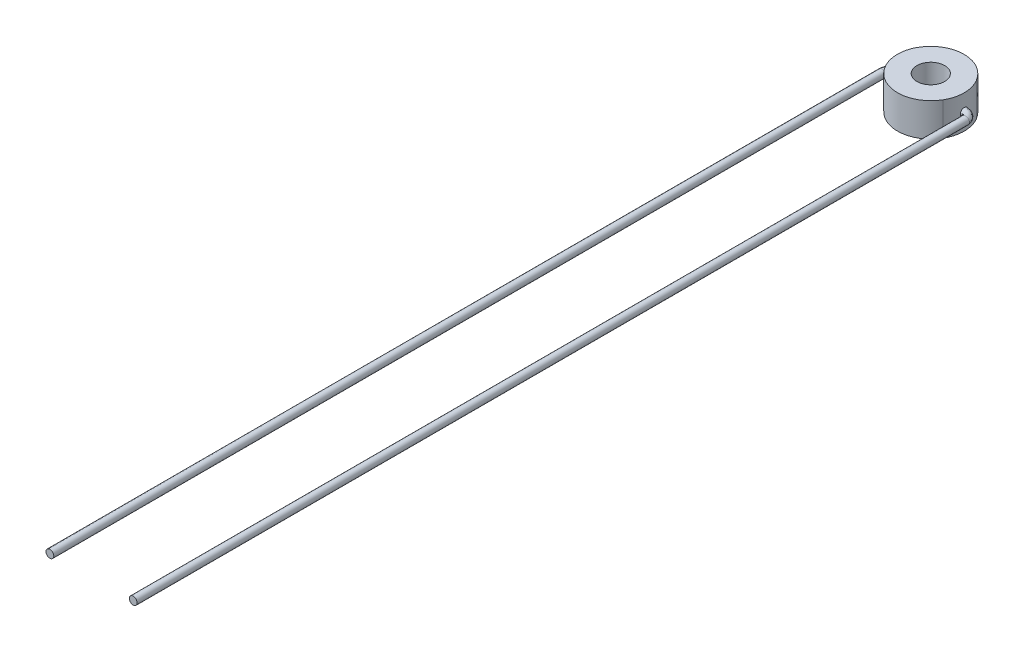
ISO-10303-21;
HEADER;
FILE_DESCRIPTION(('STEP AP214'),'2;1');
FILE_NAME('part.step','',(''),(''),'','','');
FILE_SCHEMA(('AUTOMOTIVE_DESIGN { 1 0 10303 214 1 1 1 1 }'));
ENDSEC;
DATA;
#1=APPLICATION_CONTEXT('core data for automotive mechanical design processes');
#2=APPLICATION_PROTOCOL_DEFINITION('international standard','automotive_design',2000,#1);
#3=PRODUCT_CONTEXT('',#1,'mechanical');
#4=PRODUCT('Part','Part','',(#3));
#5=PRODUCT_RELATED_PRODUCT_CATEGORY('part','',(#4));
#6=PRODUCT_DEFINITION_FORMATION('','',#4);
#7=PRODUCT_DEFINITION_CONTEXT('part definition',#1,'design');
#8=PRODUCT_DEFINITION('design','',#6,#7);
#9=PRODUCT_DEFINITION_SHAPE('','',#8);
#10=(LENGTH_UNIT() NAMED_UNIT(*) SI_UNIT(.MILLI.,.METRE.));
#11=(NAMED_UNIT(*) PLANE_ANGLE_UNIT() SI_UNIT($,.RADIAN.));
#12=(NAMED_UNIT(*) SI_UNIT($,.STERADIAN.) SOLID_ANGLE_UNIT());
#13=UNCERTAINTY_MEASURE_WITH_UNIT(LENGTH_MEASURE(1.E-05),#10,'distance_accuracy_value','');
#14=(GEOMETRIC_REPRESENTATION_CONTEXT(3) GLOBAL_UNCERTAINTY_ASSIGNED_CONTEXT((#13)) GLOBAL_UNIT_ASSIGNED_CONTEXT((#10,
#11,#12)) REPRESENTATION_CONTEXT('',''));
#15=CARTESIAN_POINT('',(0.,0.,0.));
#16=DIRECTION('',(0.,0.,1.));
#17=DIRECTION('',(1.,0.,0.));
#18=AXIS2_PLACEMENT_3D('',#15,#16,#17);
#19=CARTESIAN_POINT('',(-3.01,1.5,0.));
#20=DIRECTION('',(-1.,0.,0.));
#21=DIRECTION('',(0.,-1.,0.));
#22=AXIS2_PLACEMENT_3D('',#19,#20,#21);
#23=PLANE('',#22);
#24=CARTESIAN_POINT('',(-3.01,1.5,0.));
#25=DIRECTION('',(-1.,0.,0.));
#26=DIRECTION('',(0.,-1.,0.));
#27=AXIS2_PLACEMENT_3D('',#24,#25,#26);
#28=CIRCLE('',#27,0.35);
#29=CARTESIAN_POINT('',(-3.01,1.15,0.));
#30=VERTEX_POINT('',#29);
#31=EDGE_CURVE('E127',#30,#30,#28,.T.);
#32=ORIENTED_EDGE('',*,*,#31,.F.);
#33=EDGE_LOOP('',(#32));
#34=FACE_BOUND('',#33,.T.);
#35=ADVANCED_FACE('F114',(#34),#23,.F.);
#36=CARTESIAN_POINT('',(-3.70998545374546,1.5,75.695487290752));
#37=DIRECTION('',(0.,0.,1.));
#38=DIRECTION('',(0.,-1.,0.));
#39=AXIS2_PLACEMENT_3D('',#36,#37,#38);
#40=PLANE('',#39);
#41=CARTESIAN_POINT('',(-3.70998545374546,1.5,75.695487290752));
#42=DIRECTION('',(0.,0.,1.));
#43=DIRECTION('',(0.,-1.,0.));
#44=AXIS2_PLACEMENT_3D('',#41,#42,#43);
#45=CIRCLE('',#44,0.35);
#46=CARTESIAN_POINT('',(-3.70998545374546,1.15,75.695487290752));
#47=VERTEX_POINT('',#46);
#48=EDGE_CURVE('E122',#47,#47,#45,.T.);
#49=ORIENTED_EDGE('',*,*,#48,.T.);
#50=EDGE_LOOP('',(#49));
#51=FACE_BOUND('',#50,.T.);
#52=ADVANCED_FACE('F156',(#51),#40,.T.);
#53=CARTESIAN_POINT('',(-3.01,1.5,0.7));
#54=DIRECTION('',(0.,-1.,0.));
#55=DIRECTION('',(0.,0.,-1.));
#56=AXIS2_PLACEMENT_3D('',#53,#54,#55);
#57=TOROIDAL_SURFACE('',#56,0.7,0.35);
#58=ORIENTED_EDGE('',*,*,#31,.T.);
#59=EDGE_LOOP('',(#58));
#60=FACE_BOUND('',#59,.T.);
#61=CARTESIAN_POINT('',(-3.70998545374546,1.5,0.695487290751994));
#62=DIRECTION('',(0.,0.,1.));
#63=DIRECTION('',(0.,-1.,0.));
#64=AXIS2_PLACEMENT_3D('',#61,#62,#63);
#65=CIRCLE('',#64,0.35);
#66=CARTESIAN_POINT('',(-3.70998545374546,1.15,0.695487290751991));
#67=VERTEX_POINT('',#66);
#68=EDGE_CURVE('E14',#67,#67,#65,.T.);
#69=ORIENTED_EDGE('',*,*,#68,.F.);
#70=EDGE_LOOP('',(#69));
#71=FACE_BOUND('',#70,.T.);
#72=ADVANCED_FACE('F153',(#60,#71),#57,.T.);
#73=CARTESIAN_POINT('',(-3.70998545374546,1.5,75.695487290752));
#74=DIRECTION('',(0.,0.,-1.));
#75=DIRECTION('',(-1.,0.,0.));
#76=AXIS2_PLACEMENT_3D('',#73,#74,#75);
#77=CYLINDRICAL_SURFACE('',#76,0.35);
#78=ORIENTED_EDGE('',*,*,#68,.T.);
#79=EDGE_LOOP('',(#78));
#80=FACE_BOUND('',#79,.T.);
#81=ORIENTED_EDGE('',*,*,#48,.F.);
#82=EDGE_LOOP('',(#81));
#83=FACE_BOUND('',#82,.T.);
#84=ADVANCED_FACE('F136',(#80,#83),#77,.T.);
#85=CLOSED_SHELL('',(#35,#52,#72,#84));
#86=MANIFOLD_SOLID_BREP('B2',#85);
#87=CARTESIAN_POINT('',(3.70190913939137,1.5,75.5938786410438));
#88=DIRECTION('',(0.,0.,1.));
#89=DIRECTION('',(0.,1.,0.));
#90=AXIS2_PLACEMENT_3D('',#87,#88,#89);
#91=PLANE('',#90);
#92=CARTESIAN_POINT('',(3.70190913939137,1.5,75.5938786410438));
#93=DIRECTION('',(0.,0.,1.));
#94=DIRECTION('',(0.,1.,0.));
#95=AXIS2_PLACEMENT_3D('',#92,#93,#94);
#96=CIRCLE('',#95,0.35);
#97=CARTESIAN_POINT('',(3.70190913939137,1.85,75.5938786410438));
#98=VERTEX_POINT('',#97);
#99=EDGE_CURVE('E207',#98,#98,#96,.T.);
#100=ORIENTED_EDGE('',*,*,#99,.T.);
#101=EDGE_LOOP('',(#100));
#102=FACE_BOUND('',#101,.T.);
#103=ADVANCED_FACE('F204',(#102),#91,.T.);
#104=CARTESIAN_POINT('',(3.01,1.5,0.));
#105=DIRECTION('',(1.,0.,0.));
#106=DIRECTION('',(0.,1.,0.));
#107=AXIS2_PLACEMENT_3D('',#104,#105,#106);
#108=PLANE('',#107);
#109=CARTESIAN_POINT('',(3.01,1.5,0.));
#110=DIRECTION('',(1.,0.,0.));
#111=DIRECTION('',(0.,1.,0.));
#112=AXIS2_PLACEMENT_3D('',#109,#110,#111);
#113=CIRCLE('',#112,0.35);
#114=CARTESIAN_POINT('',(3.01,1.85,0.));
#115=VERTEX_POINT('',#114);
#116=EDGE_CURVE('E222',#115,#115,#113,.T.);
#117=ORIENTED_EDGE('',*,*,#116,.F.);
#118=EDGE_LOOP('',(#117));
#119=FACE_BOUND('',#118,.T.);
#120=ADVANCED_FACE('F254',(#119),#108,.F.);
#121=CARTESIAN_POINT('',(3.70190913939136,1.5,0.393878641043796));
#122=DIRECTION('',(0.,0.,1.));
#123=DIRECTION('',(1.,0.,0.));
#124=AXIS2_PLACEMENT_3D('',#121,#122,#123);
#125=CYLINDRICAL_SURFACE('',#124,0.35);
#126=CARTESIAN_POINT('',(3.70190913939136,1.85,0.593878641043793));
#127=CARTESIAN_POINT('',(3.70509875095758,1.85000028904591,0.593634888574644));
#128=CARTESIAN_POINT('',(3.70828942292755,1.8499566188249,0.593391059443828));
#129=CARTESIAN_POINT('',(3.73361756249484,1.84926198794336,0.591455532598646));
#130=CARTESIAN_POINT('',(3.75574155807071,1.84654466256337,0.589765063577075));
#131=CARTESIAN_POINT('',(3.79912415522836,1.8369644315722,0.586450566457041));
#132=CARTESIAN_POINT('',(3.82038011673186,1.8300897581118,0.58482674098592));
#133=CARTESIAN_POINT('',(3.85891386892801,1.81343132444031,0.581883242331707));
#134=CARTESIAN_POINT('',(3.87637027370482,1.80406134063248,0.580549896661312));
#135=CARTESIAN_POINT('',(3.90946194118485,1.78250950132745,0.578022475429364));
#136=CARTESIAN_POINT('',(3.92509740266566,1.77032795317962,0.576828384666463));
#137=CARTESIAN_POINT('',(3.95406725808427,1.74352593539413,0.574616068112743));
#138=CARTESIAN_POINT('',(3.96740649697742,1.72891073222208,0.57359747202976));
#139=CARTESIAN_POINT('',(3.99144352294984,1.69763324713445,0.571762074614816));
#140=CARTESIAN_POINT('',(4.00214082145873,1.68097058743746,0.570945310607368));
#141=CARTESIAN_POINT('',(4.02054757951009,1.64613761601463,0.569539964103643));
#142=CARTESIAN_POINT('',(4.0282676296808,1.6279729327138,0.56895057279776));
#143=CARTESIAN_POINT('',(4.04055955063391,1.59057491445537,0.568012161225167));
#144=CARTESIAN_POINT('',(4.04512724237208,1.57134019730788,0.567663460038403));
#145=CARTESIAN_POINT('',(4.05095420405049,1.53244666105543,0.567218628119672));
#146=CARTESIAN_POINT('',(4.05222572233649,1.51278968651957,0.567121562328443));
#147=CARTESIAN_POINT('',(4.05145855682738,1.47351424960726,0.567180127205562));
#148=CARTESIAN_POINT('',(4.0494154353454,1.45389587412582,0.567336096641069));
#149=CARTESIAN_POINT('',(4.04207559225901,1.41531348609709,0.567896426724581));
#150=CARTESIAN_POINT('',(4.03678400145829,1.39634849135493,0.568300395669111));
#151=CARTESIAN_POINT('',(4.02310418825135,1.3595771921419,0.569344779533845));
#152=CARTESIAN_POINT('',(4.01471592980661,1.34177090115869,0.569985197205803));
#153=CARTESIAN_POINT('',(3.99506739752509,1.3077917136248,0.571485383319128));
#154=CARTESIAN_POINT('',(3.98380244796063,1.29162153670519,0.572345508870799));
#155=CARTESIAN_POINT('',(3.9587468788521,1.26142336653387,0.574258726664808));
#156=CARTESIAN_POINT('',(3.94495960808885,1.24739257766214,0.575311563053933));
#157=CARTESIAN_POINT('',(3.9151412287881,1.22175316308247,0.577588740915868));
#158=CARTESIAN_POINT('',(3.89909568892769,1.21016141665372,0.578814185473734));
#159=CARTESIAN_POINT('',(3.86531429596909,1.18986056505301,0.581394363351572));
#160=CARTESIAN_POINT('',(3.84758082561588,1.1811474717785,0.582748914423604));
#161=CARTESIAN_POINT('',(3.81047273129596,1.16665266743693,0.585583602905312));
#162=CARTESIAN_POINT('',(3.79106899047526,1.16094608975329,0.587065969844863));
#163=CARTESIAN_POINT('',(3.75160729208483,1.15296465852912,0.590080960007776));
#164=CARTESIAN_POINT('',(3.73155112371204,1.1506811148248,0.591613445839888));
#165=CARTESIAN_POINT('',(3.70828951974915,1.15004341953096,0.593391052039836));
#166=CARTESIAN_POINT('',(3.70509884767862,1.14999975162737,0.593634881173922));
#167=CARTESIAN_POINT('',(3.70190913939136,1.14999999999984,0.593878641032459));
#168=B_SPLINE_CURVE_WITH_KNOTS('',3,(#126,#127,#128,#129,#130,#131,#132,#133,#134,#135,#136,
#137,#138,#139,#140,#141,#142,#143,#144,#145,#146,#147,#148,#149,#150,#151,#152,#153,#154,#155,
#156,#157,#158,#159,#160,#161,#162,#163,#164,#165,#166,#167),.UNSPECIFIED.,.F.,.F.,(4,2,2,2,2,2,
2,2,2,2,2,2,2,2,2,2,2,2,2,2,4),(0.,0.00959946730306152,0.0762091577325206,0.143008282858916,
0.202300054928498,0.261585348517695,0.320743976564899,0.379913536557609,0.438870634043744,
0.497905740892115,0.556721160948206,0.615615388926978,0.674416834735197,0.733218964886947,
0.79211728626202,0.850937970910124,0.910153226098493,0.969286096720651,1.02983394450847,
1.09022781568773,1.09982728299079),.UNSPECIFIED.);
#169=CARTESIAN_POINT('',(3.70190913939136,1.85,0.593878641043793));
#170=VERTEX_POINT('',#169);
#171=CARTESIAN_POINT('',(3.70190913939136,1.14999999999984,0.593878641032459));
#172=VERTEX_POINT('',#171);
#173=EDGE_CURVE('E212',#170,#172,#168,.T.);
#174=ORIENTED_EDGE('',*,*,#173,.F.);
#175=CARTESIAN_POINT('',(3.70190913939136,1.85,0.593878641043793));
#176=CARTESIAN_POINT('',(3.69871952473393,1.85000028808632,0.594122387762195));
#177=CARTESIAN_POINT('',(3.69552891578487,1.84995661807325,0.594367035785053));
#178=CARTESIAN_POINT('',(3.67020238590188,1.84926205024854,0.596315409940394));
#179=CARTESIAN_POINT('',(3.64808292099068,1.84654516923934,0.598055872028174));
#180=CARTESIAN_POINT('',(3.60471339484848,1.83696955337158,0.601535198447525));
#181=CARTESIAN_POINT('',(3.58346599228327,1.83009903132367,0.603274044074702));
#182=CARTESIAN_POINT('',(3.54493718446551,1.81344793806296,0.606482084456427));
#183=CARTESIAN_POINT('',(3.52747796588444,1.80407863641174,0.607959690595995));
#184=CARTESIAN_POINT('',(3.49438131516823,1.78252798140741,0.610801891639858));
#185=CARTESIAN_POINT('',(3.47874368972023,1.77034692685565,0.612166498531514));
#186=CARTESIAN_POINT('',(3.44975878398356,1.7435352446227,0.614732168820421));
#187=CARTESIAN_POINT('',(3.43640825941679,1.72890814591495,0.615933463369874));
#188=CARTESIAN_POINT('',(3.41235200895027,1.69760164890354,0.618128216101582));
#189=CARTESIAN_POINT('',(3.40164677520487,1.68092186956363,0.619121635603582));
#190=CARTESIAN_POINT('',(3.3832337675575,1.64605838271374,0.620851652942864));
#191=CARTESIAN_POINT('',(3.37551386958187,1.62788112984115,0.621589288283983));
#192=CARTESIAN_POINT('',(3.36322587355591,1.59045471698557,0.622773838639908));
#193=CARTESIAN_POINT('',(3.35866192044874,1.57120418308211,0.623220371283476));
#194=CARTESIAN_POINT('',(3.3528522110201,1.5323089965925,0.623790376931458));
#195=CARTESIAN_POINT('',(3.35158895644515,1.51266698090559,0.623915553504139));
#196=CARTESIAN_POINT('',(3.35236754624828,1.47342277084367,0.623838759598965));
#197=CARTESIAN_POINT('',(3.35441379650415,1.45382066439466,0.623636353015945));
#198=CARTESIAN_POINT('',(3.36174992398539,1.41529308333148,0.622918871115256));
#199=CARTESIAN_POINT('',(3.36703124223564,1.39636596228,0.622404620873979));
#200=CARTESIAN_POINT('',(3.38067686397565,1.35966797153676,0.621096224162993));
#201=CARTESIAN_POINT('',(3.38904123794964,1.34189712829053,0.620302071294223));
#202=CARTESIAN_POINT('',(3.40863996639007,1.30796311397747,0.618472373960997));
#203=CARTESIAN_POINT('',(3.41988224909686,1.29180455824568,0.617436163362057));
#204=CARTESIAN_POINT('',(3.44488678102475,1.26162416173604,0.615169770777973));
#205=CARTESIAN_POINT('',(3.45864570373543,1.24759954461193,0.613939845141219));
#206=CARTESIAN_POINT('',(3.48838338338353,1.22198208712234,0.611324132485921));
#207=CARTESIAN_POINT('',(3.50437360131866,1.21040263165138,0.609937548279125));
#208=CARTESIAN_POINT('',(3.53804039894921,1.19010846237523,0.607064402685899));
#209=CARTESIAN_POINT('',(3.55571462136048,1.18138981784626,0.605577981887781));
#210=CARTESIAN_POINT('',(3.59284514515234,1.16680998844437,0.602505911639805));
#211=CARTESIAN_POINT('',(3.61234009722672,1.16104773250232,0.600918610958639));
#212=CARTESIAN_POINT('',(3.65199826362153,1.15298917873372,0.597748071882326));
#213=CARTESIAN_POINT('',(3.67215964214875,1.15068405798977,0.596164833475884));
#214=CARTESIAN_POINT('',(3.69552882415284,1.15004341842289,0.594367043532249));
#215=CARTESIAN_POINT('',(3.69871943318809,1.14999975062149,0.594122395553183));
#216=CARTESIAN_POINT('',(3.70190913939136,1.14999999999984,0.593878641032459));
#217=B_SPLINE_CURVE_WITH_KNOTS('',3,(#175,#176,#177,#178,#179,#180,#181,#182,#183,#184,#185,
#186,#187,#188,#189,#190,#191,#192,#193,#194,#195,#196,#197,#198,#199,#200,#201,#202,#203,#204,
#205,#206,#207,#208,#209,#210,#211,#212,#213,#214,#215,#216),.UNSPECIFIED.,.F.,.F.,(4,2,2,2,2,2,
2,2,2,2,2,2,2,2,2,2,2,2,2,2,4),(0.,0.00959946754152653,0.076207333883058,0.143005112930221,
0.202334152722684,0.261656890595028,0.320894768899993,0.380143660083594,0.439149336703756,
0.498232363536292,0.557001527330176,0.615848993760136,0.674541436708027,0.733235221554526,
0.792092473178622,0.850872481867925,0.909966359552009,0.968978699529333,1.02985456751202,
1.09057480889246,1.100174276434),.UNSPECIFIED.);
#218=EDGE_CURVE('E112',#170,#172,#217,.T.);
#219=ORIENTED_EDGE('',*,*,#218,.T.);
#220=EDGE_LOOP('',(#174,#219));
#221=FACE_BOUND('',#220,.T.);
#222=ORIENTED_EDGE('',*,*,#99,.F.);
#223=EDGE_LOOP('',(#222));
#224=FACE_BOUND('',#223,.T.);
#225=ADVANCED_FACE('F230',(#221,#224),#125,.T.);
#226=CARTESIAN_POINT('',(3.01,1.85,0.));
#227=CARTESIAN_POINT('',(3.18065087577874,1.85,5.90616941247743E-08));
#228=CARTESIAN_POINT('',(3.34169264563789,1.85,0.0622076673228975));
#229=CARTESIAN_POINT('',(3.52802459323319,1.85,0.222139886050778));
#230=CARTESIAN_POINT('',(3.58069409255362,1.85,0.28636961826477));
#231=CARTESIAN_POINT('',(3.64100402025901,1.85,0.394174261113986));
#232=CARTESIAN_POINT('',(3.65801275470456,1.85,0.432015484614549));
#233=CARTESIAN_POINT('',(3.68522805177516,1.85,0.510782406830705));
#234=CARTESIAN_POINT('',(3.69542672678721,1.85,0.551713920557231));
#235=CARTESIAN_POINT('',(3.7069739945078,1.85,0.626822887782009));
#236=CARTESIAN_POINT('',(3.71201593548242,1.85,0.659774749557254));
#237=CARTESIAN_POINT('',(3.72212273157349,1.85,0.725670858070724));
#238=CARTESIAN_POINT('',(3.72717612961902,1.85,0.758618912327434));
#239=CARTESIAN_POINT('',(3.73222952766456,1.85,0.791566966584184));
#240=CARTESIAN_POINT('',(3.01,1.85,0.700000000000001));
#241=CARTESIAN_POINT('',(3.01,1.85,0.700000000000001));
#242=CARTESIAN_POINT('',(3.01000000000004,1.85,0.699999999999993));
#243=CARTESIAN_POINT('',(3.00999999999998,1.85,0.700000000000006));
#244=CARTESIAN_POINT('',(3.01,1.85,0.700000000000001));
#245=CARTESIAN_POINT('',(3.01,1.85,0.700000000000001));
#246=CARTESIAN_POINT('',(3.01,1.85,0.700000000000001));
#247=CARTESIAN_POINT('',(3.01,1.85,0.700000000000001));
#248=CARTESIAN_POINT('',(3.00676612554249,1.85,0.678915203171126));
#249=CARTESIAN_POINT('',(3.01252669902277,1.85,0.716474027128365));
#250=CARTESIAN_POINT('',(3.02010679609107,1.85,0.765896108513459));
#251=CARTESIAN_POINT('',(3.03021359218213,1.85,0.831792217026929));
#252=CARTESIAN_POINT('',(3.0352669902277,1.85,0.864740271283639));
#253=CARTESIAN_POINT('',(3.0403203882732,1.85,0.897688325540389));
#254=CARTESIAN_POINT('',(3.01,1.15,0.700000000000001));
#255=CARTESIAN_POINT('',(3.01,1.15,0.700000000000001));
#256=CARTESIAN_POINT('',(3.01000000000003,1.15,0.699999999999993));
#257=CARTESIAN_POINT('',(3.00999999999998,1.15,0.700000000000006));
#258=CARTESIAN_POINT('',(3.01,1.15,0.700000000000001));
#259=CARTESIAN_POINT('',(3.01,1.15,0.700000000000001));
#260=CARTESIAN_POINT('',(3.01,1.15,0.700000000000001));
#261=CARTESIAN_POINT('',(3.01,1.15,0.700000000000001));
#262=CARTESIAN_POINT('',(3.00676612554249,1.15,0.678915203171126));
#263=CARTESIAN_POINT('',(3.01252669902277,1.15,0.716474027128365));
#264=CARTESIAN_POINT('',(3.02010679609107,1.15,0.765896108513459));
#265=CARTESIAN_POINT('',(3.03021359218213,1.15,0.831792217026929));
#266=CARTESIAN_POINT('',(3.0352669902277,1.15,0.864740271283639));
#267=CARTESIAN_POINT('',(3.0403203882732,1.15,0.897688325540389));
#268=CARTESIAN_POINT('',(3.01,1.15,0.));
#269=CARTESIAN_POINT('',(3.18065087577874,1.15,5.90616943259616E-08));
#270=CARTESIAN_POINT('',(3.34169264563789,1.15,0.0622076673228979));
#271=CARTESIAN_POINT('',(3.52802459323319,1.15,0.222139886050779));
#272=CARTESIAN_POINT('',(3.58069409255362,1.15,0.28636961826477));
#273=CARTESIAN_POINT('',(3.64100402025901,1.15,0.394174261113986));
#274=CARTESIAN_POINT('',(3.65801275470456,1.15,0.432015484614549));
#275=CARTESIAN_POINT('',(3.68522805177516,1.15,0.510782406830705));
#276=CARTESIAN_POINT('',(3.69542672678721,1.15,0.551713920557231));
#277=CARTESIAN_POINT('',(3.7069739945078,1.15,0.626822887782009));
#278=CARTESIAN_POINT('',(3.71201593548242,1.15,0.659774749557254));
#279=CARTESIAN_POINT('',(3.72212273157349,1.15,0.725670858070725));
#280=CARTESIAN_POINT('',(3.72717612961902,1.15,0.758618912327435));
#281=CARTESIAN_POINT('',(3.73222952766456,1.15,0.791566966584184));
#282=CARTESIAN_POINT('',(3.01,1.15,-0.699999999999999));
#283=CARTESIAN_POINT('',(3.35130175155748,1.15,-0.699999881876613));
#284=CARTESIAN_POINT('',(3.67338529127574,1.15,-0.575584665354197));
#285=CARTESIAN_POINT('',(4.04604918646641,1.15,-0.255720227898449));
#286=CARTESIAN_POINT('',(4.15138818510724,1.15,-0.127260763470459));
#287=CARTESIAN_POINT('',(4.27200804051802,1.15,0.088348522227972));
#288=CARTESIAN_POINT('',(4.30602550940912,1.15,0.164030969229098));
#289=CARTESIAN_POINT('',(4.36045610355032,1.15,0.32156481366141));
#290=CARTESIAN_POINT('',(4.38408732803194,1.15,0.424512637943337));
#291=CARTESIAN_POINT('',(4.40142128999284,1.15,0.537171748435655));
#292=CARTESIAN_POINT('',(4.40392507487378,1.15,0.55365339060105));
#293=CARTESIAN_POINT('',(4.41403187096485,1.15,0.619549499114521));
#294=CARTESIAN_POINT('',(4.41908526901035,1.15,0.652497553371231));
#295=CARTESIAN_POINT('',(4.42413866705591,1.15,0.68544560762798));
#296=CARTESIAN_POINT('',(3.01,1.85,-0.699999999999999));
#297=CARTESIAN_POINT('',(3.35130175155748,1.85,-0.699999881876613));
#298=CARTESIAN_POINT('',(3.67338529127574,1.85,-0.575584665354197));
#299=CARTESIAN_POINT('',(4.04604918646641,1.85,-0.255720227898449));
#300=CARTESIAN_POINT('',(4.15138818510724,1.85,-0.127260763470459));
#301=CARTESIAN_POINT('',(4.27200804051802,1.85,0.088348522227972));
#302=CARTESIAN_POINT('',(4.30602550940912,1.85,0.164030969229098));
#303=CARTESIAN_POINT('',(4.36045610355032,1.85,0.32156481366141));
#304=CARTESIAN_POINT('',(4.38408732803194,1.85,0.424512637943337));
#305=CARTESIAN_POINT('',(4.40142128999284,1.85,0.537171748435655));
#306=CARTESIAN_POINT('',(4.40392507487378,1.85,0.55365339060105));
#307=CARTESIAN_POINT('',(4.41403187096485,1.85,0.619549499114521));
#308=CARTESIAN_POINT('',(4.41908526901035,1.85,0.652497553371231));
#309=CARTESIAN_POINT('',(4.42413866705591,1.85,0.68544560762798));
#310=CARTESIAN_POINT('',(3.01,1.85,0.));
#311=CARTESIAN_POINT('',(3.18065087577874,1.85,5.90616941247743E-08));
#312=CARTESIAN_POINT('',(3.34169264563789,1.85,0.0622076673228975));
#313=CARTESIAN_POINT('',(3.52802459323319,1.85,0.222139886050778));
#314=CARTESIAN_POINT('',(3.58069409255362,1.85,0.28636961826477));
#315=CARTESIAN_POINT('',(3.64100402025901,1.85,0.394174261113986));
#316=CARTESIAN_POINT('',(3.65801275470456,1.85,0.432015484614549));
#317=CARTESIAN_POINT('',(3.68522805177516,1.85,0.510782406830705));
#318=CARTESIAN_POINT('',(3.69542672678721,1.85,0.551713920557231));
#319=CARTESIAN_POINT('',(3.7069739945078,1.85,0.626822887782009));
#320=CARTESIAN_POINT('',(3.71201593548242,1.85,0.659774749557254));
#321=CARTESIAN_POINT('',(3.72212273157349,1.85,0.725670858070724));
#322=CARTESIAN_POINT('',(3.72717612961902,1.85,0.758618912327434));
#323=CARTESIAN_POINT('',(3.73222952766456,1.85,0.791566966584184));
#324=(BOUNDED_SURFACE() B_SPLINE_SURFACE(3,3,((#226,#227,#228,#229,#230,#231,#232,#233,#234,
#235,#236,#237,#238,#239),(#240,#241,#242,#243,#244,#245,#246,#247,#248,#249,#250,#251,#252,
#253),(#254,#255,#256,#257,#258,#259,#260,#261,#262,#263,#264,#265,#266,#267),(#268,#269,#270,
#271,#272,#273,#274,#275,#276,#277,#278,#279,#280,#281),(#282,#283,#284,#285,#286,#287,#288,
#289,#290,#291,#292,#293,#294,#295),(#296,#297,#298,#299,#300,#301,#302,#303,#304,#305,#306,
#307,#308,#309),(#310,#311,#312,#313,#314,#315,#316,#317,#318,#319,#320,#321,#322,#323)),
.UNSPECIFIED.,.T.,.F.,.F.) B_SPLINE_SURFACE_WITH_KNOTS((4,3,4),(4,2,2,2,2,2,4),(0.,0.5,1.),(0.,
0.5,0.75,0.875,1.,1.09766531817965,1.19533063635931),
.UNSPECIFIED.) GEOMETRIC_REPRESENTATION_ITEM() RATIONAL_B_SPLINE_SURFACE(((1.,1.,1.,1.,1.,1.,1.,
1.,1.,1.,1.,1.,1.,1.),(0.333333333333333,0.333333333333333,0.333333333333333,0.333333333333333,
0.333333333333333,0.333333333333333,0.333333333333333,0.333333333333333,0.333333333333333,
0.333333333333333,0.333333333333333,0.333333333333333,0.333333333333333,0.333333333333333),
(0.333333333333333,0.333333333333333,0.333333333333333,0.333333333333333,0.333333333333333,
0.333333333333333,0.333333333333333,0.333333333333333,0.333333333333333,0.333333333333333,
0.333333333333333,0.333333333333333,0.333333333333333,0.333333333333333),(1.,1.,1.,1.,1.,1.,1.,
1.,1.,1.,1.,1.,1.,1.),(0.333333333333333,0.333333333333333,0.333333333333333,0.333333333333333,
0.333333333333333,0.333333333333333,0.333333333333333,0.333333333333333,0.333333333333333,
0.333333333333333,0.333333333333333,0.333333333333333,0.333333333333333,0.333333333333333),
(0.333333333333333,0.333333333333333,0.333333333333333,0.333333333333333,0.333333333333333,
0.333333333333333,0.333333333333333,0.333333333333333,0.333333333333333,0.333333333333333,
0.333333333333333,0.333333333333333,0.333333333333333,0.333333333333333),(1.,1.,1.,1.,1.,1.,1.,
1.,1.,1.,1.,1.,1.,1.))) REPRESENTATION_ITEM('') SURFACE());
#325=ORIENTED_EDGE('',*,*,#218,.F.);
#326=ORIENTED_EDGE('',*,*,#173,.T.);
#327=EDGE_LOOP('',(#325,#326));
#328=FACE_BOUND('',#327,.T.);
#329=ORIENTED_EDGE('',*,*,#116,.T.);
#330=EDGE_LOOP('',(#329));
#331=FACE_BOUND('',#330,.T.);
#332=ADVANCED_FACE('F233',(#328,#331),#324,.T.);
#333=CLOSED_SHELL('',(#103,#120,#225,#332));
#334=MANIFOLD_SOLID_BREP('B8',#333);
#335=CARTESIAN_POINT('',(0.,3.,0.));
#336=DIRECTION('',(0.,-1.,0.));
#337=DIRECTION('',(0.,0.,-1.));
#338=AXIS2_PLACEMENT_3D('',#335,#336,#337);
#339=CYLINDRICAL_SURFACE('',#338,3.);
#340=CARTESIAN_POINT('',(1.94211216983686,1.5,-2.28652581874152));
#341=CARTESIAN_POINT('',(1.9422034898872,1.5665587849258,-2.2864482540013));
#342=CARTESIAN_POINT('',(1.96239680467796,1.62993034525101,-2.26962366961741));
#343=CARTESIAN_POINT('',(2.0322774795455,1.72362301051194,-2.20727004846032));
#344=CARTESIAN_POINT('',(2.07895572804727,1.74998679026068,-2.16386933616423));
#345=CARTESIAN_POINT('',(2.17243625675623,1.75001320769235,-2.0700019646134));
#346=CARTESIAN_POINT('',(2.21563145984994,1.72360414229513,-2.02315886755828));
#347=CARTESIAN_POINT('',(2.27772070653457,1.62994918270724,-1.95299333134553));
#348=CARTESIAN_POINT('',(2.29445007165519,1.56598267405536,-1.93274387407611));
#349=CARTESIAN_POINT('',(2.29460304992351,1.43401728003895,-1.93256225187676));
#350=CARTESIAN_POINT('',(2.27770838622855,1.37006965979657,-1.95300725499107));
#351=CARTESIAN_POINT('',(2.2156437368506,1.27637695073922,-2.02314499285107));
#352=CARTESIAN_POINT('',(2.17243603206761,1.25001326972375,-2.07000219166791));
#353=CARTESIAN_POINT('',(2.07895588796234,1.24998673162326,-2.16386917415133));
#354=CARTESIAN_POINT('',(2.0322915008972,1.27639565485097,-2.20725753806646));
#355=CARTESIAN_POINT('',(1.96238273507586,1.37005105455172,-2.26963622306448));
#356=CARTESIAN_POINT('',(1.94202084978651,1.4334412150742,-2.28660338348174));
#357=CARTESIAN_POINT('',(1.94211216983686,1.5,-2.28652581874152));
#358=B_SPLINE_CURVE_WITH_KNOTS('',3,(#340,#341,#342,#343,#344,#345,#346,#347,#348,#349,#350,
#351,#352,#353,#354,#355,#356,#357),.UNSPECIFIED.,.T.,.F.,(4,2,2,2,2,2,2,2,4),(0.,0.125,0.25,
0.375,0.5,0.625,0.75,0.875,1.),.UNSPECIFIED.);
#359=CARTESIAN_POINT('',(1.94211216983686,1.5,-2.28652581874152));
#360=VERTEX_POINT('',#359);
#361=EDGE_CURVE('E202',#360,#360,#358,.T.);
#362=ORIENTED_EDGE('',*,*,#361,.F.);
#363=EDGE_LOOP('',(#362));
#364=FACE_BOUND('',#363,.T.);
#365=CARTESIAN_POINT('',(0.,0.,0.));
#366=DIRECTION('',(0.,1.,0.));
#367=DIRECTION('',(0.,0.,1.));
#368=AXIS2_PLACEMENT_3D('',#365,#366,#367);
#369=CIRCLE('',#368,3.);
#370=CARTESIAN_POINT('',(2.60345753903295,0.,-1.49064041353121));
#371=VERTEX_POINT('',#370);
#372=CARTESIAN_POINT('',(-2.63722209020871,0.,-1.43005581951028));
#373=VERTEX_POINT('',#372);
#374=EDGE_CURVE('E539',#371,#373,#369,.T.);
#375=ORIENTED_EDGE('',*,*,#374,.T.);
#376=CARTESIAN_POINT('',(-2.63484992286745,2.99999588517728,-1.4344217943009));
#377=CARTESIAN_POINT('',(-2.63564185033554,1.99999725678485,-1.43296712452628));
#378=CARTESIAN_POINT('',(-2.63643257314415,0.999998628392427,-1.43151179893069));
#379=CARTESIAN_POINT('',(-2.63722209020871,0.,-1.43005581951028));
#380=B_SPLINE_CURVE_WITH_KNOTS('',3,(#376,#377,#378,#379),.UNSPECIFIED.,.F.,.F.,(4,4),(0.,1.),.UNSPECIFIED.);
#381=CARTESIAN_POINT('',(-2.63484992286745,3.,-1.4344217943009));
#382=VERTEX_POINT('',#381);
#383=EDGE_CURVE('E317',#373,#382,#380,.F.);
#384=ORIENTED_EDGE('',*,*,#383,.T.);
#385=CARTESIAN_POINT('',(0.,3.,0.));
#386=DIRECTION('',(0.,1.,0.));
#387=DIRECTION('',(0.,0.,1.));
#388=AXIS2_PLACEMENT_3D('',#385,#386,#387);
#389=CIRCLE('',#388,3.);
#390=CARTESIAN_POINT('',(2.60345753903295,3.,-1.49064041353121));
#391=VERTEX_POINT('',#390);
#392=EDGE_CURVE('E302',#391,#382,#389,.T.);
#393=ORIENTED_EDGE('',*,*,#392,.F.);
#394=DIRECTION('',(0.,1.,0.));
#395=VECTOR('',#394,1.);
#396=CARTESIAN_POINT('',(2.60345753903295,0.,-1.49064041353121));
#397=LINE('',#396,#395);
#398=EDGE_CURVE('E454',#371,#391,#397,.T.);
#399=ORIENTED_EDGE('',*,*,#398,.F.);
#400=EDGE_LOOP('',(#375,#384,#393,#399));
#401=FACE_BOUND('',#400,.T.);
#402=ADVANCED_FACE('F289',(#364,#401),#339,.T.);
#403=CARTESIAN_POINT('',(-2.6348499196088,3.,1.43442180028662));
#404=VERTEX_POINT('',#403);
#405=CARTESIAN_POINT('',(2.60345753903295,3.,1.49064041353121));
#406=VERTEX_POINT('',#405);
#407=EDGE_CURVE('E309',#404,#406,#389,.T.);
#408=ORIENTED_EDGE('',*,*,#407,.F.);
#409=DIRECTION('',(0.,-1.,0.));
#410=VECTOR('',#409,1.);
#411=CARTESIAN_POINT('',(-2.6348499196088,3.,1.43442180028662));
#412=LINE('',#411,#410);
#413=CARTESIAN_POINT('',(-2.6348499196088,0.,1.43442180028662));
#414=VERTEX_POINT('',#413);
#415=EDGE_CURVE('E567',#404,#414,#412,.T.);
#416=ORIENTED_EDGE('',*,*,#415,.T.);
#417=CARTESIAN_POINT('',(2.60345753903295,0.,1.49064041353121));
#418=VERTEX_POINT('',#417);
#419=EDGE_CURVE('E526',#414,#418,#369,.T.);
#420=ORIENTED_EDGE('',*,*,#419,.T.);
#421=DIRECTION('',(0.,-1.,0.));
#422=VECTOR('',#421,1.);
#423=CARTESIAN_POINT('',(2.60345753903295,3.,1.49064041353121));
#424=LINE('',#423,#422);
#425=EDGE_CURVE('E448',#406,#418,#424,.T.);
#426=ORIENTED_EDGE('',*,*,#425,.F.);
#427=EDGE_LOOP('',(#408,#416,#420,#426));
#428=FACE_BOUND('',#427,.T.);
#429=ADVANCED_FACE('F291',(#428),#339,.T.);
#430=CARTESIAN_POINT('',(0.,3.,0.));
#431=DIRECTION('',(0.,1.,0.));
#432=DIRECTION('',(0.,0.,1.));
#433=AXIS2_PLACEMENT_3D('',#430,#431,#432);
#434=PLANE('',#433);
#435=CARTESIAN_POINT('',(0.,3.,0.));
#436=DIRECTION('',(0.,1.,0.));
#437=DIRECTION('',(0.,0.,1.));
#438=AXIS2_PLACEMENT_3D('',#435,#436,#437);
#439=CIRCLE('',#438,1.25);
#440=CARTESIAN_POINT('',(0.,3.,1.25));
#441=VERTEX_POINT('',#440);
#442=EDGE_CURVE('E518',#441,#441,#439,.T.);
#443=ORIENTED_EDGE('',*,*,#442,.F.);
#444=EDGE_LOOP('',(#443));
#445=FACE_BOUND('',#444,.T.);
#446=ORIENTED_EDGE('',*,*,#392,.T.);
#447=CARTESIAN_POINT('',(-2.64363275594367,2.99999588517728,-1.4392032002819));
#448=CARTESIAN_POINT('',(-2.63484992286745,2.99999588517728,-1.4344217943009));
#449=B_SPLINE_CURVE_WITH_KNOTS('',1,(#447,#448),.UNSPECIFIED.,.F.,.F.,(2,2),(0.,1.),.UNSPECIFIED.);
#450=CARTESIAN_POINT('',(-2.64363275594367,2.99999588517728,-1.4392032002819));
#451=VERTEX_POINT('',#450);
#452=EDGE_CURVE('E372',#382,#451,#449,.F.);
#453=ORIENTED_EDGE('',*,*,#452,.T.);
#454=CARTESIAN_POINT('',(0.,2.99999588517728,0.));
#455=DIRECTION('',(0.,-1.,0.));
#456=DIRECTION('',(0.,0.,-1.));
#457=AXIS2_PLACEMENT_3D('',#454,#455,#456);
#458=CIRCLE('',#457,3.01);
#459=CARTESIAN_POINT('',(-2.64363275267416,2.99999588517728,1.43920320628757));
#460=VERTEX_POINT('',#459);
#461=EDGE_CURVE('E390',#451,#460,#458,.F.);
#462=ORIENTED_EDGE('',*,*,#461,.T.);
#463=DIRECTION('',(-0.878283306536267,0.,0.478140600095539));
#464=VECTOR('',#463,1.);
#465=CARTESIAN_POINT('',(-2.6348499196088,3.,1.43442180028662));
#466=LINE('',#465,#464);
#467=EDGE_CURVE('E441',#404,#460,#466,.T.);
#468=ORIENTED_EDGE('',*,*,#467,.F.);
#469=ORIENTED_EDGE('',*,*,#407,.T.);
#470=DIRECTION('',(0.867819179677649,0.,0.496880137843738));
#471=VECTOR('',#470,1.);
#472=CARTESIAN_POINT('',(2.60345753903295,3.,1.49064041353121));
#473=LINE('',#472,#471);
#474=CARTESIAN_POINT('',(2.61213573082973,3.,1.49560921490965));
#475=VERTEX_POINT('',#474);
#476=EDGE_CURVE('E458',#406,#475,#473,.T.);
#477=ORIENTED_EDGE('',*,*,#476,.T.);
#478=CARTESIAN_POINT('',(0.,3.,0.));
#479=DIRECTION('',(0.,-1.,0.));
#480=DIRECTION('',(0.,0.,-1.));
#481=AXIS2_PLACEMENT_3D('',#478,#479,#480);
#482=CIRCLE('',#481,3.01);
#483=CARTESIAN_POINT('',(2.61213573082973,3.,-1.49560921490965));
#484=VERTEX_POINT('',#483);
#485=EDGE_CURVE('E450',#475,#484,#482,.F.);
#486=ORIENTED_EDGE('',*,*,#485,.T.);
#487=DIRECTION('',(0.86781917967765,0.,-0.496880137843737));
#488=VECTOR('',#487,1.);
#489=CARTESIAN_POINT('',(2.60345753903295,3.,-1.49064041353121));
#490=LINE('',#489,#488);
#491=EDGE_CURVE('E468',#391,#484,#490,.T.);
#492=ORIENTED_EDGE('',*,*,#491,.F.);
#493=EDGE_LOOP('',(#446,#453,#462,#468,#469,#477,#486,#492));
#494=FACE_BOUND('',#493,.T.);
#495=ADVANCED_FACE('F563',(#445,#494),#434,.T.);
#496=CARTESIAN_POINT('',(0.,0.,0.));
#497=DIRECTION('',(0.,1.,0.));
#498=DIRECTION('',(0.,0.,1.));
#499=AXIS2_PLACEMENT_3D('',#496,#497,#498);
#500=PLANE('',#499);
#501=CARTESIAN_POINT('',(0.,0.,0.));
#502=DIRECTION('',(0.,1.,0.));
#503=DIRECTION('',(0.,0.,1.));
#504=AXIS2_PLACEMENT_3D('',#501,#502,#503);
#505=CIRCLE('',#504,1.25);
#506=CARTESIAN_POINT('',(0.,0.,1.25));
#507=VERTEX_POINT('',#506);
#508=EDGE_CURVE('E527',#507,#507,#505,.T.);
#509=ORIENTED_EDGE('',*,*,#508,.T.);
#510=EDGE_LOOP('',(#509));
#511=FACE_BOUND('',#510,.T.);
#512=ORIENTED_EDGE('',*,*,#374,.F.);
#513=DIRECTION('',(0.86781917967765,0.,-0.496880137843737));
#514=VECTOR('',#513,1.);
#515=CARTESIAN_POINT('',(2.60345753903295,0.,-1.49064041353121));
#516=LINE('',#515,#514);
#517=CARTESIAN_POINT('',(2.61213573082973,0.,-1.49560921490965));
#518=VERTEX_POINT('',#517);
#519=EDGE_CURVE('E470',#371,#518,#516,.T.);
#520=ORIENTED_EDGE('',*,*,#519,.T.);
#521=CARTESIAN_POINT('',(0.,0.,0.));
#522=DIRECTION('',(0.,-1.,0.));
#523=DIRECTION('',(0.,0.,-1.));
#524=AXIS2_PLACEMENT_3D('',#521,#522,#523);
#525=CIRCLE('',#524,3.01);
#526=CARTESIAN_POINT('',(2.61213573082973,0.,1.49560921490965));
#527=VERTEX_POINT('',#526);
#528=EDGE_CURVE('E459',#527,#518,#525,.F.);
#529=ORIENTED_EDGE('',*,*,#528,.F.);
#530=DIRECTION('',(0.867819179677649,0.,0.496880137843738));
#531=VECTOR('',#530,1.);
#532=CARTESIAN_POINT('',(2.60345753903295,0.,1.49064041353121));
#533=LINE('',#532,#531);
#534=EDGE_CURVE('E472',#418,#527,#533,.T.);
#535=ORIENTED_EDGE('',*,*,#534,.F.);
#536=ORIENTED_EDGE('',*,*,#419,.F.);
#537=DIRECTION('',(-0.878283306536267,0.,0.478140600095539));
#538=VECTOR('',#537,1.);
#539=CARTESIAN_POINT('',(-2.6348499196088,0.,1.43442180028662));
#540=LINE('',#539,#538);
#541=CARTESIAN_POINT('',(-2.64363275267416,0.,1.43920320628757));
#542=VERTEX_POINT('',#541);
#543=EDGE_CURVE('E373',#414,#542,#540,.T.);
#544=ORIENTED_EDGE('',*,*,#543,.T.);
#545=CARTESIAN_POINT('',(0.,0.,0.));
#546=DIRECTION('',(0.,-1.,0.));
#547=DIRECTION('',(0.,0.,-1.));
#548=AXIS2_PLACEMENT_3D('',#545,#546,#547);
#549=CIRCLE('',#548,3.01);
#550=CARTESIAN_POINT('',(-2.64601283050941,0.,-1.43482267224198));
#551=VERTEX_POINT('',#550);
#552=EDGE_CURVE('E377',#551,#542,#549,.F.);
#553=ORIENTED_EDGE('',*,*,#552,.F.);
#554=CARTESIAN_POINT('',(-2.63722209020871,0.,-1.43005581951028));
#555=CARTESIAN_POINT('',(-2.64601283050941,0.,-1.43482267224198));
#556=B_SPLINE_CURVE_WITH_KNOTS('',1,(#554,#555),.UNSPECIFIED.,.F.,.F.,(2,2),(0.,1.),.UNSPECIFIED.);
#557=EDGE_CURVE('E361',#373,#551,#556,.T.);
#558=ORIENTED_EDGE('',*,*,#557,.F.);
#559=EDGE_LOOP('',(#512,#520,#529,#535,#536,#544,#553,#558));
#560=FACE_BOUND('',#559,.T.);
#561=ADVANCED_FACE('F378',(#511,#560),#500,.F.);
#562=CARTESIAN_POINT('',(0.,3.,0.));
#563=DIRECTION('',(0.,-1.,0.));
#564=DIRECTION('',(0.,0.,-1.));
#565=AXIS2_PLACEMENT_3D('',#562,#563,#564);
#566=CYLINDRICAL_SURFACE('',#565,1.25);
#567=ORIENTED_EDGE('',*,*,#442,.T.);
#568=EDGE_LOOP('',(#567));
#569=FACE_BOUND('',#568,.T.);
#570=ORIENTED_EDGE('',*,*,#508,.F.);
#571=EDGE_LOOP('',(#570));
#572=FACE_BOUND('',#571,.T.);
#573=ADVANCED_FACE('F502',(#569,#572),#566,.F.);
#574=CARTESIAN_POINT('',(1.94858587706965,1.5,-2.29414757147066));
#575=CARTESIAN_POINT('',(1.94867750152016,1.5665587849258,-2.29406974818131));
#576=CARTESIAN_POINT('',(1.96893812736022,1.62993034525101,-2.27718908184946));
#577=CARTESIAN_POINT('',(2.03905173781065,1.72362301051194,-2.21462761528852));
#578=CARTESIAN_POINT('',(2.0858855804741,1.74998679026068,-2.17108223395145));
#579=CARTESIAN_POINT('',(2.17967771094542,1.75001320769235,-2.07690197116212));
#580=CARTESIAN_POINT('',(2.22301689804944,1.72360414229513,-2.02990273045014));
#581=CARTESIAN_POINT('',(2.28531310888969,1.62994918270724,-1.95950330911669));
#582=CARTESIAN_POINT('',(2.30209823856071,1.56598267405536,-1.93918635365636));
#583=CARTESIAN_POINT('',(2.30225172675659,1.43401728003895,-1.93900412604968));
#584=CARTESIAN_POINT('',(2.28530074751598,1.37006965979657,-1.95951727917437));
#585=CARTESIAN_POINT('',(2.22302921597343,1.27637695073922,-2.02988880949391));
#586=CARTESIAN_POINT('',(2.17967748550784,1.25001326972375,-2.07690219897347));
#587=CARTESIAN_POINT('',(2.08588574092221,1.24998673162326,-2.1710820713985));
#588=CARTESIAN_POINT('',(2.03906580590019,1.27639565485097,-2.21461506319335));
#589=CARTESIAN_POINT('',(1.96892401085944,1.37005105455172,-2.27720167714136));
#590=CARTESIAN_POINT('',(1.94849425261913,1.4334412150742,-2.29422539476001));
#591=CARTESIAN_POINT('',(1.94858587706965,1.5,-2.29414757147066));
#592=CARTESIAN_POINT('',(1.94211216983686,1.5,-2.28652581874152));
#593=CARTESIAN_POINT('',(1.9422034898872,1.5665587849258,-2.2864482540013));
#594=CARTESIAN_POINT('',(1.96239680467796,1.62993034525101,-2.26962366961741));
#595=CARTESIAN_POINT('',(2.0322774795455,1.72362301051194,-2.20727004846032));
#596=CARTESIAN_POINT('',(2.07895572804727,1.74998679026068,-2.16386933616423));
#597=CARTESIAN_POINT('',(2.17243625675623,1.75001320769235,-2.0700019646134));
#598=CARTESIAN_POINT('',(2.21563145984994,1.72360414229513,-2.02315886755828));
#599=CARTESIAN_POINT('',(2.27772070653457,1.62994918270724,-1.95299333134553));
#600=CARTESIAN_POINT('',(2.29445007165519,1.56598267405536,-1.93274387407611));
#601=CARTESIAN_POINT('',(2.29460304992351,1.43401728003895,-1.93256225187676));
#602=CARTESIAN_POINT('',(2.27770838622855,1.37006965979657,-1.95300725499107));
#603=CARTESIAN_POINT('',(2.2156437368506,1.27637695073922,-2.02314499285107));
#604=CARTESIAN_POINT('',(2.17243603206761,1.25001326972375,-2.07000219166791));
#605=CARTESIAN_POINT('',(2.07895588796234,1.24998673162326,-2.16386917415133));
#606=CARTESIAN_POINT('',(2.0322915008972,1.27639565485097,-2.20725753806646));
#607=CARTESIAN_POINT('',(1.96238273507586,1.37005105455172,-2.26963622306448));
#608=CARTESIAN_POINT('',(1.94202084978651,1.4334412150742,-2.28660338348174));
#609=CARTESIAN_POINT('',(1.94211216983686,1.5,-2.28652581874152));
#610=B_SPLINE_SURFACE_WITH_KNOTS('',1,3,((#574,#575,#576,#577,#578,#579,#580,#581,#582,#583,
#584,#585,#586,#587,#588,#589,#590,#591),(#592,#593,#594,#595,#596,#597,#598,#599,#600,#601,
#602,#603,#604,#605,#606,#607,#608,#609)),.UNSPECIFIED.,.F.,.T.,.F.,(2,2),(4,2,2,2,2,2,2,2,4),
(0.,1.),(0.,0.125,0.25,0.375,0.5,0.625,0.75,0.875,1.),.UNSPECIFIED.);
#611=CARTESIAN_POINT('',(1.94858587706965,1.5,-2.29414757147066));
#612=CARTESIAN_POINT('',(1.94849425261913,1.4334412150742,-2.29422539476001));
#613=CARTESIAN_POINT('',(1.96892401085944,1.37005105455172,-2.27720167714136));
#614=CARTESIAN_POINT('',(2.03906580590019,1.27639565485097,-2.21461506319335));
#615=CARTESIAN_POINT('',(2.08588574092221,1.24998673162326,-2.1710820713985));
#616=CARTESIAN_POINT('',(2.17967748550784,1.25001326972375,-2.07690219897347));
#617=CARTESIAN_POINT('',(2.22302921597343,1.27637695073922,-2.02988880949391));
#618=CARTESIAN_POINT('',(2.28530074751598,1.37006965979657,-1.95951727917437));
#619=CARTESIAN_POINT('',(2.30225172675659,1.43401728003895,-1.93900412604968));
#620=CARTESIAN_POINT('',(2.30209823856071,1.56598267405536,-1.93918635365636));
#621=CARTESIAN_POINT('',(2.28531310888969,1.62994918270724,-1.95950330911669));
#622=CARTESIAN_POINT('',(2.22301689804944,1.72360414229513,-2.02990273045014));
#623=CARTESIAN_POINT('',(2.17967771094542,1.75001320769235,-2.07690197116212));
#624=CARTESIAN_POINT('',(2.0858855804741,1.74998679026068,-2.17108223395145));
#625=CARTESIAN_POINT('',(2.03905173781065,1.72362301051194,-2.21462761528852));
#626=CARTESIAN_POINT('',(1.96893812736022,1.62993034525101,-2.27718908184946));
#627=CARTESIAN_POINT('',(1.94867750152016,1.5665587849258,-2.29406974818131));
#628=CARTESIAN_POINT('',(1.94858587706965,1.5,-2.29414757147066));
#629=B_SPLINE_CURVE_WITH_KNOTS('',3,(#611,#612,#613,#614,#615,#616,#617,#618,#619,#620,#621,
#622,#623,#624,#625,#626,#627,#628),.UNSPECIFIED.,.T.,.F.,(4,2,2,2,2,2,2,2,4),(0.,0.125,0.25,
0.375,0.5,0.625,0.75,0.875,1.),.UNSPECIFIED.);
#630=CARTESIAN_POINT('',(1.94858587706965,1.5,-2.29414757147066));
#631=VERTEX_POINT('',#630);
#632=EDGE_CURVE('E474',#631,#631,#629,.F.);
#633=ORIENTED_EDGE('',*,*,#632,.F.);
#634=EDGE_LOOP('',(#633));
#635=FACE_BOUND('',#634,.T.);
#636=ORIENTED_EDGE('',*,*,#361,.T.);
#637=EDGE_LOOP('',(#636));
#638=FACE_BOUND('',#637,.T.);
#639=ADVANCED_FACE('F493',(#635,#638),#610,.T.);
#640=CARTESIAN_POINT('',(0.,3.,0.));
#641=DIRECTION('',(0.,-1.,0.));
#642=DIRECTION('',(0.,0.,-1.));
#643=AXIS2_PLACEMENT_3D('',#640,#641,#642);
#644=CYLINDRICAL_SURFACE('',#643,3.01);
#645=ORIENTED_EDGE('',*,*,#632,.T.);
#646=EDGE_LOOP('',(#645));
#647=FACE_BOUND('',#646,.T.);
#648=ADVANCED_FACE('F482',(#647),#644,.T.);
#649=CARTESIAN_POINT('',(2.60345753903295,1.5,-1.49064041353121));
#650=DIRECTION('',(-0.496880137843737,0.,-0.86781917967765));
#651=DIRECTION('',(0.,1.,0.));
#652=AXIS2_PLACEMENT_3D('',#649,#650,#651);
#653=PLANE('',#652);
#654=ORIENTED_EDGE('',*,*,#519,.F.);
#655=ORIENTED_EDGE('',*,*,#398,.T.);
#656=ORIENTED_EDGE('',*,*,#491,.T.);
#657=DIRECTION('',(0.,-1.,0.));
#658=VECTOR('',#657,1.);
#659=CARTESIAN_POINT('',(2.61213573082973,3.,-1.49560921490965));
#660=LINE('',#659,#658);
#661=EDGE_CURVE('E455',#518,#484,#660,.F.);
#662=ORIENTED_EDGE('',*,*,#661,.F.);
#663=EDGE_LOOP('',(#654,#655,#656,#662));
#664=FACE_BOUND('',#663,.T.);
#665=ADVANCED_FACE('F492',(#664),#653,.T.);
#666=CARTESIAN_POINT('',(2.60345753903295,1.5,1.49064041353121));
#667=DIRECTION('',(-0.496880137843738,0.,0.867819179677649));
#668=DIRECTION('',(0.,-1.,0.));
#669=AXIS2_PLACEMENT_3D('',#666,#667,#668);
#670=PLANE('',#669);
#671=ORIENTED_EDGE('',*,*,#425,.T.);
#672=ORIENTED_EDGE('',*,*,#534,.T.);
#673=DIRECTION('',(0.,-1.,0.));
#674=VECTOR('',#673,1.);
#675=CARTESIAN_POINT('',(2.61213573082973,3.,1.49560921490965));
#676=LINE('',#675,#674);
#677=EDGE_CURVE('E453',#475,#527,#676,.T.);
#678=ORIENTED_EDGE('',*,*,#677,.F.);
#679=ORIENTED_EDGE('',*,*,#476,.F.);
#680=EDGE_LOOP('',(#671,#672,#678,#679));
#681=FACE_BOUND('',#680,.T.);
#682=ADVANCED_FACE('F495',(#681),#670,.T.);
#683=CARTESIAN_POINT('',(0.,3.,0.));
#684=DIRECTION('',(0.,-1.,0.));
#685=DIRECTION('',(0.,0.,-1.));
#686=AXIS2_PLACEMENT_3D('',#683,#684,#685);
#687=CYLINDRICAL_SURFACE('',#686,3.01);
#688=ORIENTED_EDGE('',*,*,#485,.F.);
#689=ORIENTED_EDGE('',*,*,#677,.T.);
#690=ORIENTED_EDGE('',*,*,#528,.T.);
#691=ORIENTED_EDGE('',*,*,#661,.T.);
#692=EDGE_LOOP('',(#688,#689,#690,#691));
#693=FACE_BOUND('',#692,.T.);
#694=ADVANCED_FACE('F414',(#693),#687,.T.);
#695=CARTESIAN_POINT('',(-2.64601283050941,0.,-1.43482267224198));
#696=CARTESIAN_POINT('',(-2.6452206817213,0.999998628392426,-1.43628350492713));
#697=CARTESIAN_POINT('',(-2.64442732316999,1.99999725678486,-1.43774368160803));
#698=CARTESIAN_POINT('',(-2.64363275594367,2.99999588517728,-1.4392032002819));
#699=CARTESIAN_POINT('',(-2.63722209020871,0.,-1.43005581951028));
#700=CARTESIAN_POINT('',(-2.63643257314415,0.999998628392427,-1.43151179893069));
#701=CARTESIAN_POINT('',(-2.63564185033554,1.99999725678485,-1.43296712452628));
#702=CARTESIAN_POINT('',(-2.63484992286745,2.99999588517728,-1.4344217943009));
#703=B_SPLINE_SURFACE_WITH_KNOTS('',1,3,((#695,#696,#697,#698),(#699,#700,#701,#702)),
.UNSPECIFIED.,.F.,.F.,.F.,(2,2),(4,4),(0.,1.),(0.,1.),.UNSPECIFIED.);
#704=CARTESIAN_POINT('',(-2.64601283050941,0.,-1.43482267224198));
#705=CARTESIAN_POINT('',(-2.6452206817213,0.999998628392426,-1.43628350492713));
#706=CARTESIAN_POINT('',(-2.64442732316999,1.99999725678486,-1.43774368160803));
#707=CARTESIAN_POINT('',(-2.64363275594367,2.99999588517728,-1.4392032002819));
#708=B_SPLINE_CURVE_WITH_KNOTS('',3,(#704,#705,#706,#707),.UNSPECIFIED.,.F.,.F.,(4,4),(0.,1.),.UNSPECIFIED.);
#709=EDGE_CURVE('E367',#551,#451,#708,.T.);
#710=ORIENTED_EDGE('',*,*,#452,.F.);
#711=ORIENTED_EDGE('',*,*,#383,.F.);
#712=ORIENTED_EDGE('',*,*,#557,.T.);
#713=ORIENTED_EDGE('',*,*,#709,.T.);
#714=EDGE_LOOP('',(#710,#711,#712,#713));
#715=FACE_BOUND('',#714,.T.);
#716=ADVANCED_FACE('F365',(#715),#703,.F.);
#717=CARTESIAN_POINT('',(-2.6348499196088,1.5,1.43442180028662));
#718=DIRECTION('',(-0.478140600095539,0.,-0.878283306536267));
#719=DIRECTION('',(0.,-1.,0.));
#720=AXIS2_PLACEMENT_3D('',#717,#718,#719);
#721=PLANE('',#720);
#722=ORIENTED_EDGE('',*,*,#415,.F.);
#723=ORIENTED_EDGE('',*,*,#467,.T.);
#724=DIRECTION('',(0.,-1.,0.));
#725=VECTOR('',#724,1.);
#726=CARTESIAN_POINT('',(-2.64363275267416,3.,1.43920320628757));
#727=LINE('',#726,#725);
#728=EDGE_CURVE('E384',#460,#542,#727,.T.);
#729=ORIENTED_EDGE('',*,*,#728,.T.);
#730=ORIENTED_EDGE('',*,*,#543,.F.);
#731=EDGE_LOOP('',(#722,#723,#729,#730));
#732=FACE_BOUND('',#731,.T.);
#733=ADVANCED_FACE('F408',(#732),#721,.F.);
#734=CARTESIAN_POINT('',(0.,3.,0.));
#735=DIRECTION('',(0.,-1.,0.));
#736=DIRECTION('',(0.,0.,-1.));
#737=AXIS2_PLACEMENT_3D('',#734,#735,#736);
#738=CYLINDRICAL_SURFACE('',#737,3.01);
#739=ORIENTED_EDGE('',*,*,#552,.T.);
#740=ORIENTED_EDGE('',*,*,#728,.F.);
#741=ORIENTED_EDGE('',*,*,#461,.F.);
#742=ORIENTED_EDGE('',*,*,#709,.F.);
#743=EDGE_LOOP('',(#739,#740,#741,#742));
#744=FACE_BOUND('',#743,.T.);
#745=ADVANCED_FACE('F388',(#744),#738,.T.);
#746=CLOSED_SHELL('',(#402,#429,#495,#561,#573,#639,#648,#665,#682,#694,#716,#733,#745));
#747=MANIFOLD_SOLID_BREP('B106',#746);
#748=ADVANCED_BREP_SHAPE_REPRESENTATION('',(#18,#86,#334,#747),#14);
#749=SHAPE_DEFINITION_REPRESENTATION(#9,#748);
ENDSEC;
END-ISO-10303-21;
